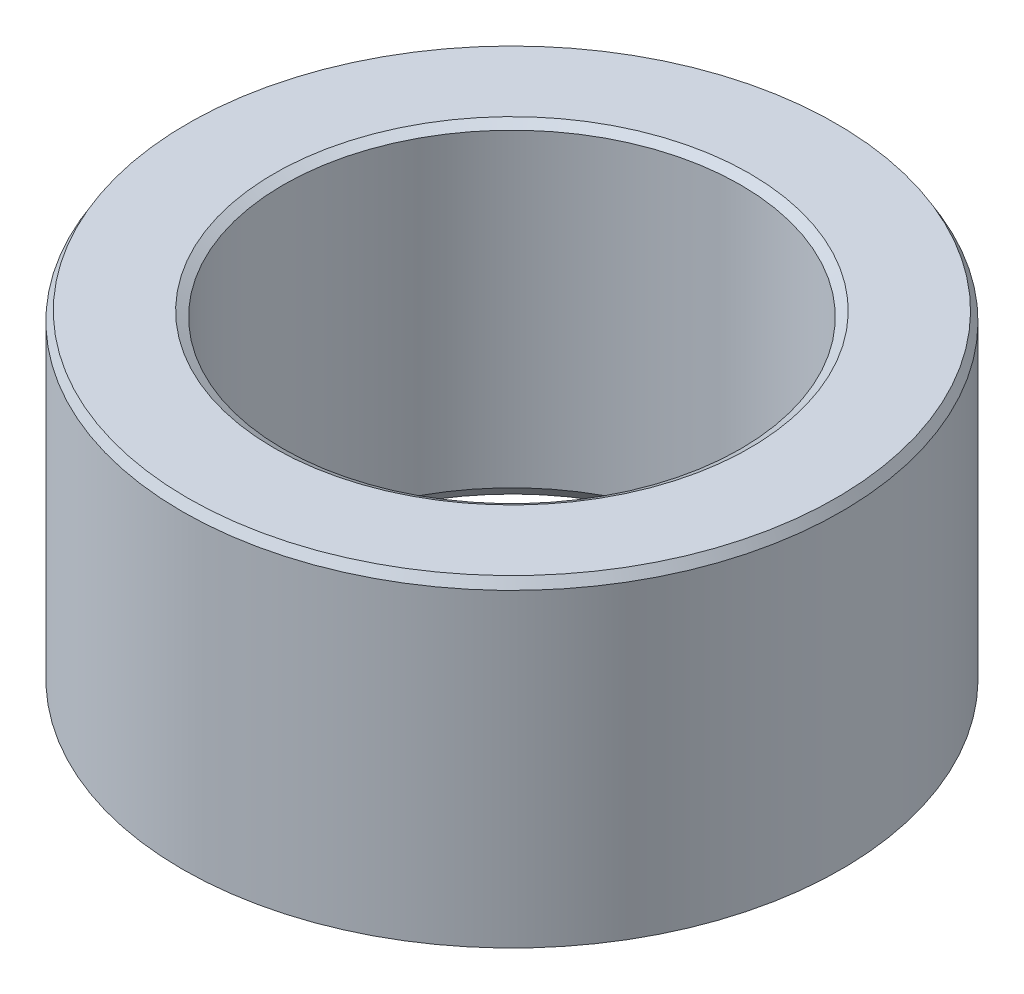
ISO-10303-21;
HEADER;
FILE_DESCRIPTION(('STEP AP214'),'2;1');
FILE_NAME('part.step','',(''),(''),'','','');
FILE_SCHEMA(('AUTOMOTIVE_DESIGN { 1 0 10303 214 1 1 1 1 }'));
ENDSEC;
DATA;
#1=APPLICATION_CONTEXT('core data for automotive mechanical design processes');
#2=APPLICATION_PROTOCOL_DEFINITION('international standard','automotive_design',2000,#1);
#3=PRODUCT_CONTEXT('',#1,'mechanical');
#4=PRODUCT('Part','Part','',(#3));
#5=PRODUCT_RELATED_PRODUCT_CATEGORY('part','',(#4));
#6=PRODUCT_DEFINITION_FORMATION('','',#4);
#7=PRODUCT_DEFINITION_CONTEXT('part definition',#1,'design');
#8=PRODUCT_DEFINITION('design','',#6,#7);
#9=PRODUCT_DEFINITION_SHAPE('','',#8);
#10=(LENGTH_UNIT() NAMED_UNIT(*) SI_UNIT(.MILLI.,.METRE.));
#11=(NAMED_UNIT(*) PLANE_ANGLE_UNIT() SI_UNIT($,.RADIAN.));
#12=(NAMED_UNIT(*) SI_UNIT($,.STERADIAN.) SOLID_ANGLE_UNIT());
#13=UNCERTAINTY_MEASURE_WITH_UNIT(LENGTH_MEASURE(1.E-05),#10,'distance_accuracy_value','');
#14=(GEOMETRIC_REPRESENTATION_CONTEXT(3) GLOBAL_UNCERTAINTY_ASSIGNED_CONTEXT((#13)) GLOBAL_UNIT_ASSIGNED_CONTEXT((#10,
#11,#12)) REPRESENTATION_CONTEXT('',''));
#15=CARTESIAN_POINT('',(0.,0.,0.));
#16=DIRECTION('',(0.,0.,1.));
#17=DIRECTION('',(1.,0.,0.));
#18=AXIS2_PLACEMENT_3D('',#15,#16,#17);
#19=CARTESIAN_POINT('',(0.,12.2934042024233,0.));
#20=DIRECTION('',(0.,-1.,0.));
#21=DIRECTION('',(0.,0.,-1.));
#22=AXIS2_PLACEMENT_3D('',#19,#20,#21);
#23=CYLINDRICAL_SURFACE('',#22,12.5);
#24=CARTESIAN_POINT('',(0.,0.199963011378481,0.));
#25=DIRECTION('',(0.,1.,0.));
#26=DIRECTION('',(0.,0.,1.));
#27=AXIS2_PLACEMENT_3D('',#24,#25,#26);
#28=CIRCLE('',#27,12.5);
#29=CARTESIAN_POINT('',(0.,0.199963011378481,12.5));
#30=VERTEX_POINT('',#29);
#31=EDGE_CURVE('E10',#30,#30,#28,.T.);
#32=ORIENTED_EDGE('',*,*,#31,.T.);
#33=EDGE_LOOP('',(#32));
#34=FACE_BOUND('',#33,.T.);
#35=CARTESIAN_POINT('',(0.,11.9470581070813,0.));
#36=DIRECTION('',(0.,1.,0.));
#37=DIRECTION('',(0.,0.,1.));
#38=AXIS2_PLACEMENT_3D('',#35,#36,#37);
#39=CIRCLE('',#38,12.5);
#40=CARTESIAN_POINT('',(0.,11.9470581070813,12.5));
#41=VERTEX_POINT('',#40);
#42=EDGE_CURVE('E50',#41,#41,#39,.F.);
#43=ORIENTED_EDGE('',*,*,#42,.T.);
#44=EDGE_LOOP('',(#43));
#45=FACE_BOUND('',#44,.T.);
#46=ADVANCED_FACE('F39',(#34,#45),#23,.T.);
#47=CARTESIAN_POINT('',(0.,12.2934042024233,0.));
#48=DIRECTION('',(0.,1.,0.));
#49=DIRECTION('',(0.,0.,1.));
#50=AXIS2_PLACEMENT_3D('',#47,#48,#49);
#51=PLANE('',#50);
#52=CARTESIAN_POINT('',(0.,12.2934042024233,0.));
#53=DIRECTION('',(0.,1.,0.));
#54=DIRECTION('',(0.,0.,1.));
#55=AXIS2_PLACEMENT_3D('',#52,#53,#54);
#56=CIRCLE('',#55,9.01978190979134);
#57=CARTESIAN_POINT('',(0.,12.2934042024233,9.01978190979134));
#58=VERTEX_POINT('',#57);
#59=EDGE_CURVE('E58',#58,#58,#56,.F.);
#60=ORIENTED_EDGE('',*,*,#59,.T.);
#61=EDGE_LOOP('',(#60));
#62=FACE_BOUND('',#61,.T.);
#63=CARTESIAN_POINT('',(0.,12.2934042024233,0.));
#64=DIRECTION('',(0.,1.,0.));
#65=DIRECTION('',(0.,0.,1.));
#66=AXIS2_PLACEMENT_3D('',#63,#64,#65);
#67=CIRCLE('',#66,12.3000369886215);
#68=CARTESIAN_POINT('',(0.,12.2934042024233,12.3000369886215));
#69=VERTEX_POINT('',#68);
#70=EDGE_CURVE('E61',#69,#69,#67,.T.);
#71=ORIENTED_EDGE('',*,*,#70,.T.);
#72=EDGE_LOOP('',(#71));
#73=FACE_BOUND('',#72,.T.);
#74=ADVANCED_FACE('F88',(#62,#73),#51,.T.);
#75=CARTESIAN_POINT('',(0.,0.,0.));
#76=DIRECTION('',(0.,1.,0.));
#77=DIRECTION('',(0.,0.,1.));
#78=AXIS2_PLACEMENT_3D('',#75,#76,#77);
#79=PLANE('',#78);
#80=CARTESIAN_POINT('',(0.,0.,0.));
#81=DIRECTION('',(0.,1.,0.));
#82=DIRECTION('',(0.,0.,1.));
#83=AXIS2_PLACEMENT_3D('',#80,#81,#82);
#84=CIRCLE('',#83,8.87339882582781);
#85=CARTESIAN_POINT('',(0.,0.,8.87339882582781));
#86=VERTEX_POINT('',#85);
#87=EDGE_CURVE('E51',#86,#86,#84,.T.);
#88=ORIENTED_EDGE('',*,*,#87,.T.);
#89=EDGE_LOOP('',(#88));
#90=FACE_BOUND('',#89,.T.);
#91=CARTESIAN_POINT('',(0.,0.,0.));
#92=DIRECTION('',(0.,1.,0.));
#93=DIRECTION('',(0.,0.,1.));
#94=AXIS2_PLACEMENT_3D('',#91,#92,#93);
#95=CIRCLE('',#94,12.153653904658);
#96=CARTESIAN_POINT('',(0.,0.,12.153653904658));
#97=VERTEX_POINT('',#96);
#98=EDGE_CURVE('E54',#97,#97,#95,.F.);
#99=ORIENTED_EDGE('',*,*,#98,.T.);
#100=EDGE_LOOP('',(#99));
#101=FACE_BOUND('',#100,.T.);
#102=ADVANCED_FACE('F83',(#90,#101),#79,.F.);
#103=CARTESIAN_POINT('',(0.,12.2934042024233,0.));
#104=DIRECTION('',(0.,-1.,0.));
#105=DIRECTION('',(0.,0.,-1.));
#106=AXIS2_PLACEMENT_3D('',#103,#104,#105);
#107=CYLINDRICAL_SURFACE('',#106,8.67343581444933);
#108=CARTESIAN_POINT('',(0.,12.0934411910448,0.));
#109=DIRECTION('',(0.,1.,0.));
#110=DIRECTION('',(0.,0.,1.));
#111=AXIS2_PLACEMENT_3D('',#108,#109,#110);
#112=CIRCLE('',#111,8.67343581444933);
#113=CARTESIAN_POINT('',(0.,12.0934411910448,8.67343581444933));
#114=VERTEX_POINT('',#113);
#115=EDGE_CURVE('E67',#114,#114,#112,.T.);
#116=ORIENTED_EDGE('',*,*,#115,.T.);
#117=EDGE_LOOP('',(#116));
#118=FACE_BOUND('',#117,.T.);
#119=CARTESIAN_POINT('',(0.,0.346346095342015,0.));
#120=DIRECTION('',(0.,1.,0.));
#121=DIRECTION('',(0.,0.,1.));
#122=AXIS2_PLACEMENT_3D('',#119,#120,#121);
#123=CIRCLE('',#122,8.67343581444933);
#124=CARTESIAN_POINT('',(0.,0.346346095342015,8.67343581444933));
#125=VERTEX_POINT('',#124);
#126=EDGE_CURVE('E69',#125,#125,#123,.F.);
#127=ORIENTED_EDGE('',*,*,#126,.T.);
#128=EDGE_LOOP('',(#127));
#129=FACE_BOUND('',#128,.T.);
#130=ADVANCED_FACE('F71',(#118,#129),#107,.F.);
#131=CARTESIAN_POINT('',(0.,12.0934411910448,0.));
#132=DIRECTION('',(0.,1.,0.));
#133=DIRECTION('',(0.,0.,1.));
#134=AXIS2_PLACEMENT_3D('',#131,#132,#133);
#135=CONICAL_SURFACE('',#134,8.67343581444933,1.0471975511966);
#136=ORIENTED_EDGE('',*,*,#59,.F.);
#137=EDGE_LOOP('',(#136));
#138=FACE_BOUND('',#137,.T.);
#139=ORIENTED_EDGE('',*,*,#115,.F.);
#140=EDGE_LOOP('',(#139));
#141=FACE_BOUND('',#140,.T.);
#142=ADVANCED_FACE('F77',(#138,#141),#135,.F.);
#143=CARTESIAN_POINT('',(0.,0.,0.));
#144=DIRECTION('',(0.,-1.,0.));
#145=DIRECTION('',(0.,0.,-1.));
#146=AXIS2_PLACEMENT_3D('',#143,#144,#145);
#147=CONICAL_SURFACE('',#146,8.87339882582781,0.523598775598294);
#148=ORIENTED_EDGE('',*,*,#126,.F.);
#149=EDGE_LOOP('',(#148));
#150=FACE_BOUND('',#149,.T.);
#151=ORIENTED_EDGE('',*,*,#87,.F.);
#152=EDGE_LOOP('',(#151));
#153=FACE_BOUND('',#152,.T.);
#154=ADVANCED_FACE('F73',(#150,#153),#147,.F.);
#155=CARTESIAN_POINT('',(0.,0.199963011378481,0.));
#156=DIRECTION('',(0.,1.,0.));
#157=DIRECTION('',(0.,0.,1.));
#158=AXIS2_PLACEMENT_3D('',#155,#156,#157);
#159=CONICAL_SURFACE('',#158,12.5,1.04719755119659);
#160=ORIENTED_EDGE('',*,*,#98,.F.);
#161=EDGE_LOOP('',(#160));
#162=FACE_BOUND('',#161,.T.);
#163=ORIENTED_EDGE('',*,*,#31,.F.);
#164=EDGE_LOOP('',(#163));
#165=FACE_BOUND('',#164,.T.);
#166=ADVANCED_FACE('F76',(#162,#165),#159,.T.);
#167=CARTESIAN_POINT('',(0.,12.2934042024233,0.));
#168=DIRECTION('',(0.,-1.,0.));
#169=DIRECTION('',(0.,0.,-1.));
#170=AXIS2_PLACEMENT_3D('',#167,#168,#169);
#171=CONICAL_SURFACE('',#170,12.3000369886215,0.523598775598296);
#172=ORIENTED_EDGE('',*,*,#42,.F.);
#173=EDGE_LOOP('',(#172));
#174=FACE_BOUND('',#173,.T.);
#175=ORIENTED_EDGE('',*,*,#70,.F.);
#176=EDGE_LOOP('',(#175));
#177=FACE_BOUND('',#176,.T.);
#178=ADVANCED_FACE('F45',(#174,#177),#171,.T.);
#179=CLOSED_SHELL('',(#46,#74,#102,#130,#142,#154,#166,#178));
#180=MANIFOLD_SOLID_BREP('B2',#179);
#181=ADVANCED_BREP_SHAPE_REPRESENTATION('',(#18,#180),#14);
#182=SHAPE_DEFINITION_REPRESENTATION(#9,#181);
ENDSEC;
END-ISO-10303-21;
